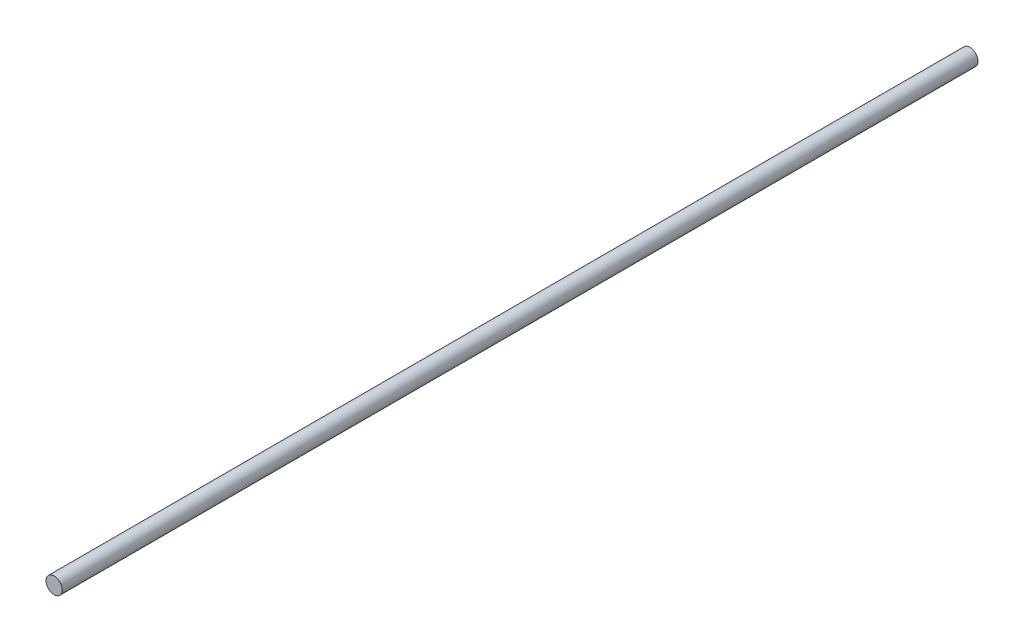
ISO-10303-21;
HEADER;
FILE_DESCRIPTION(('STEP AP214'),'2;1');
FILE_NAME('part.step','',(''),(''),'','','');
FILE_SCHEMA(('AUTOMOTIVE_DESIGN { 1 0 10303 214 1 1 1 1 }'));
ENDSEC;
DATA;
#1=APPLICATION_CONTEXT('core data for automotive mechanical design processes');
#2=APPLICATION_PROTOCOL_DEFINITION('international standard','automotive_design',2000,#1);
#3=PRODUCT_CONTEXT('',#1,'mechanical');
#4=PRODUCT('Part','Part','',(#3));
#5=PRODUCT_RELATED_PRODUCT_CATEGORY('part','',(#4));
#6=PRODUCT_DEFINITION_FORMATION('','',#4);
#7=PRODUCT_DEFINITION_CONTEXT('part definition',#1,'design');
#8=PRODUCT_DEFINITION('design','',#6,#7);
#9=PRODUCT_DEFINITION_SHAPE('','',#8);
#10=(LENGTH_UNIT() NAMED_UNIT(*) SI_UNIT(.MILLI.,.METRE.));
#11=(NAMED_UNIT(*) PLANE_ANGLE_UNIT() SI_UNIT($,.RADIAN.));
#12=(NAMED_UNIT(*) SI_UNIT($,.STERADIAN.) SOLID_ANGLE_UNIT());
#13=UNCERTAINTY_MEASURE_WITH_UNIT(LENGTH_MEASURE(1.E-05),#10,'distance_accuracy_value','');
#14=(GEOMETRIC_REPRESENTATION_CONTEXT(3) GLOBAL_UNCERTAINTY_ASSIGNED_CONTEXT((#13)) GLOBAL_UNIT_ASSIGNED_CONTEXT((#10,
#11,#12)) REPRESENTATION_CONTEXT('',''));
#15=CARTESIAN_POINT('',(0.,0.,0.));
#16=DIRECTION('',(0.,0.,1.));
#17=DIRECTION('',(1.,0.,0.));
#18=AXIS2_PLACEMENT_3D('',#15,#16,#17);
#19=CARTESIAN_POINT('',(-6.92426235031009,1.80200631984917,450.));
#20=DIRECTION('',(0.,0.,-1.));
#21=DIRECTION('',(-1.,0.,0.));
#22=AXIS2_PLACEMENT_3D('',#19,#20,#21);
#23=CYLINDRICAL_SURFACE('',#22,4.);
#24=CARTESIAN_POINT('',(-6.92426235031009,1.80200631984917,450.));
#25=DIRECTION('',(0.,0.,1.));
#26=DIRECTION('',(1.,0.,0.));
#27=AXIS2_PLACEMENT_3D('',#24,#25,#26);
#28=CIRCLE('',#27,4.);
#29=CARTESIAN_POINT('',(-2.92426235031009,1.80200631984917,450.));
#30=VERTEX_POINT('',#29);
#31=EDGE_CURVE('E12',#30,#30,#28,.T.);
#32=ORIENTED_EDGE('',*,*,#31,.F.);
#33=EDGE_LOOP('',(#32));
#34=FACE_BOUND('',#33,.T.);
#35=CARTESIAN_POINT('',(-6.92426235031009,1.80200631984917,0.));
#36=DIRECTION('',(0.,0.,1.));
#37=DIRECTION('',(1.,0.,0.));
#38=AXIS2_PLACEMENT_3D('',#35,#36,#37);
#39=CIRCLE('',#38,4.);
#40=CARTESIAN_POINT('',(-2.92426235031009,1.80200631984917,0.));
#41=VERTEX_POINT('',#40);
#42=EDGE_CURVE('E45',#41,#41,#39,.T.);
#43=ORIENTED_EDGE('',*,*,#42,.T.);
#44=EDGE_LOOP('',(#43));
#45=FACE_BOUND('',#44,.T.);
#46=ADVANCED_FACE('F42',(#34,#45),#23,.T.);
#47=CARTESIAN_POINT('',(-6.92426235031009,1.80200631984917,450.));
#48=DIRECTION('',(0.,0.,1.));
#49=DIRECTION('',(1.,0.,0.));
#50=AXIS2_PLACEMENT_3D('',#47,#48,#49);
#51=PLANE('',#50);
#52=ORIENTED_EDGE('',*,*,#31,.T.);
#53=EDGE_LOOP('',(#52));
#54=FACE_BOUND('',#53,.T.);
#55=ADVANCED_FACE('F57',(#54),#51,.T.);
#56=CARTESIAN_POINT('',(-6.92426235031009,1.80200631984917,0.));
#57=DIRECTION('',(0.,0.,1.));
#58=DIRECTION('',(1.,0.,0.));
#59=AXIS2_PLACEMENT_3D('',#56,#57,#58);
#60=PLANE('',#59);
#61=ORIENTED_EDGE('',*,*,#42,.F.);
#62=EDGE_LOOP('',(#61));
#63=FACE_BOUND('',#62,.T.);
#64=ADVANCED_FACE('F55',(#63),#60,.F.);
#65=CLOSED_SHELL('',(#46,#55,#64));
#66=MANIFOLD_SOLID_BREP('B2',#65);
#67=ADVANCED_BREP_SHAPE_REPRESENTATION('',(#18,#66),#14);
#68=SHAPE_DEFINITION_REPRESENTATION(#9,#67);
ENDSEC;
END-ISO-10303-21;
